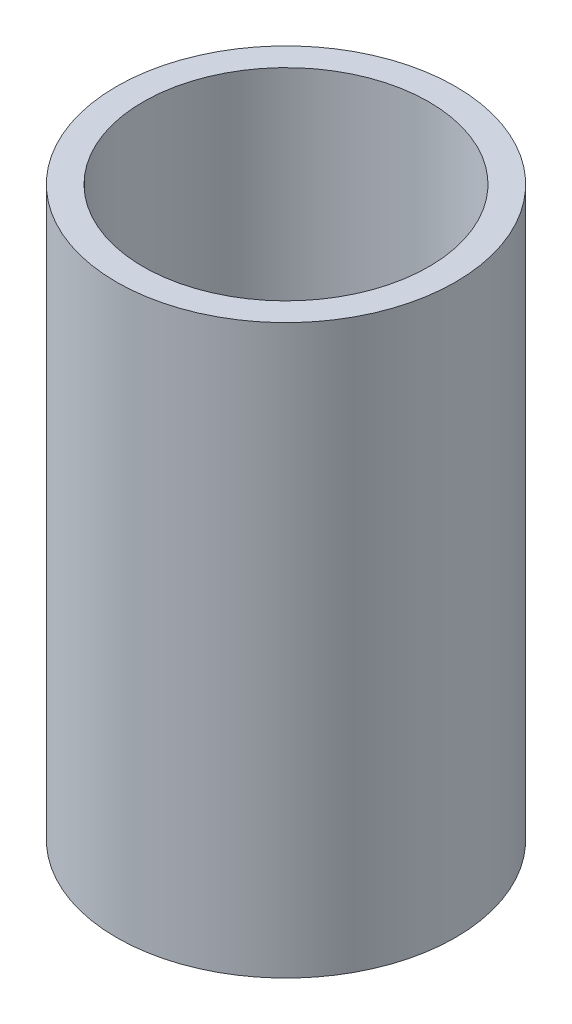
ISO-10303-21;
HEADER;
FILE_DESCRIPTION(('STEP AP214'),'2;1');
FILE_NAME('part.step','',(''),(''),'','','');
FILE_SCHEMA(('AUTOMOTIVE_DESIGN { 1 0 10303 214 1 1 1 1 }'));
ENDSEC;
DATA;
#1=APPLICATION_CONTEXT('core data for automotive mechanical design processes');
#2=APPLICATION_PROTOCOL_DEFINITION('international standard','automotive_design',2000,#1);
#3=PRODUCT_CONTEXT('',#1,'mechanical');
#4=PRODUCT('Part','Part','',(#3));
#5=PRODUCT_RELATED_PRODUCT_CATEGORY('part','',(#4));
#6=PRODUCT_DEFINITION_FORMATION('','',#4);
#7=PRODUCT_DEFINITION_CONTEXT('part definition',#1,'design');
#8=PRODUCT_DEFINITION('design','',#6,#7);
#9=PRODUCT_DEFINITION_SHAPE('','',#8);
#10=(LENGTH_UNIT() NAMED_UNIT(*) SI_UNIT(.MILLI.,.METRE.));
#11=(NAMED_UNIT(*) PLANE_ANGLE_UNIT() SI_UNIT($,.RADIAN.));
#12=(NAMED_UNIT(*) SI_UNIT($,.STERADIAN.) SOLID_ANGLE_UNIT());
#13=UNCERTAINTY_MEASURE_WITH_UNIT(LENGTH_MEASURE(1.E-05),#10,'distance_accuracy_value','');
#14=(GEOMETRIC_REPRESENTATION_CONTEXT(3) GLOBAL_UNCERTAINTY_ASSIGNED_CONTEXT((#13)) GLOBAL_UNIT_ASSIGNED_CONTEXT((#10,
#11,#12)) REPRESENTATION_CONTEXT('',''));
#15=CARTESIAN_POINT('',(0.,0.,0.));
#16=DIRECTION('',(0.,0.,1.));
#17=DIRECTION('',(1.,0.,0.));
#18=AXIS2_PLACEMENT_3D('',#15,#16,#17);
#19=CARTESIAN_POINT('',(0.,83.7349142978828,0.));
#20=DIRECTION('',(0.,-1.,0.));
#21=DIRECTION('',(0.,0.,-1.));
#22=AXIS2_PLACEMENT_3D('',#19,#20,#21);
#23=CYLINDRICAL_SURFACE('',#22,25.);
#24=CARTESIAN_POINT('',(0.,83.7349142978828,0.));
#25=DIRECTION('',(0.,1.,0.));
#26=DIRECTION('',(0.,0.,1.));
#27=AXIS2_PLACEMENT_3D('',#24,#25,#26);
#28=CIRCLE('',#27,25.);
#29=CARTESIAN_POINT('',(0.,83.7349142978828,-25.));
#30=VERTEX_POINT('',#29);
#31=EDGE_CURVE('E10',#30,#30,#28,.T.);
#32=CARTESIAN_POINT('',(0.,0.,0.));
#33=DIRECTION('',(0.,1.,0.));
#34=DIRECTION('',(0.,0.,1.));
#35=AXIS2_PLACEMENT_3D('',#32,#33,#34);
#36=CIRCLE('',#35,25.);
#37=CARTESIAN_POINT('',(0.,0.,-25.));
#38=VERTEX_POINT('',#37);
#39=EDGE_CURVE('E37',#38,#38,#36,.T.);
#40=CARTESIAN_POINT('',(0.,83.7349142978828,-25.));
#41=CARTESIAN_POINT('',(0.,82.8626756072798,-25.));
#42=CARTESIAN_POINT('',(0.,81.9904369166769,-25.));
#43=CARTESIAN_POINT('',(0.,80.245959535471,-25.));
#44=CARTESIAN_POINT('',(0.,79.373720844868,-25.));
#45=CARTESIAN_POINT('',(0.,77.6292434636621,-25.));
#46=CARTESIAN_POINT('',(0.,76.7570047730592,-25.));
#47=CARTESIAN_POINT('',(0.,75.0125273918533,-25.));
#48=CARTESIAN_POINT('',(0.,74.1402887012503,-25.));
#49=CARTESIAN_POINT('',(0.,72.3958113200445,-25.));
#50=CARTESIAN_POINT('',(0.,71.5235726294415,-25.));
#51=CARTESIAN_POINT('',(0.,69.7790952482356,-25.));
#52=CARTESIAN_POINT('',(0.,68.9068565576327,-25.));
#53=CARTESIAN_POINT('',(0.,67.1623791764268,-25.));
#54=CARTESIAN_POINT('',(0.,66.2901404858238,-25.));
#55=CARTESIAN_POINT('',(0.,64.5456631046179,-25.));
#56=CARTESIAN_POINT('',(0.,63.673424414015,-25.));
#57=CARTESIAN_POINT('',(0.,61.9289470328091,-25.));
#58=CARTESIAN_POINT('',(0.,61.0567083422062,-25.));
#59=CARTESIAN_POINT('',(0.,59.3122309610003,-25.));
#60=CARTESIAN_POINT('',(0.,58.4399922703973,-25.));
#61=CARTESIAN_POINT('',(0.,56.6955148891914,-25.));
#62=CARTESIAN_POINT('',(0.,55.8232761985885,-25.));
#63=CARTESIAN_POINT('',(0.,54.0787988173826,-25.));
#64=CARTESIAN_POINT('',(0.,53.2065601267797,-25.));
#65=CARTESIAN_POINT('',(0.,51.4620827455738,-25.));
#66=CARTESIAN_POINT('',(0.,50.5898440549708,-25.));
#67=CARTESIAN_POINT('',(0.,48.8453666737649,-25.));
#68=CARTESIAN_POINT('',(0.,47.973127983162,-25.));
#69=CARTESIAN_POINT('',(0.,46.2286506019561,-25.));
#70=CARTESIAN_POINT('',(0.,45.3564119113531,-25.));
#71=CARTESIAN_POINT('',(0.,43.6119345301473,-25.));
#72=CARTESIAN_POINT('',(0.,42.7396958395443,-25.));
#73=CARTESIAN_POINT('',(0.,40.9952184583384,-25.));
#74=CARTESIAN_POINT('',(0.,40.1229797677355,-25.));
#75=CARTESIAN_POINT('',(0.,38.3785023865296,-25.));
#76=CARTESIAN_POINT('',(0.,37.5062636959266,-25.));
#77=CARTESIAN_POINT('',(0.,35.7617863147208,-25.));
#78=CARTESIAN_POINT('',(0.,34.8895476241178,-25.));
#79=CARTESIAN_POINT('',(0.,33.1450702429119,-25.));
#80=CARTESIAN_POINT('',(0.,32.272831552309,-25.));
#81=CARTESIAN_POINT('',(0.,30.5283541711031,-25.));
#82=CARTESIAN_POINT('',(0.,29.6561154805001,-25.));
#83=CARTESIAN_POINT('',(0.,27.9116380992942,-25.));
#84=CARTESIAN_POINT('',(0.,27.0393994086913,-25.));
#85=CARTESIAN_POINT('',(0.,25.2949220274854,-25.));
#86=CARTESIAN_POINT('',(0.,24.4226833368825,-25.));
#87=CARTESIAN_POINT('',(0.,22.6782059556766,-25.));
#88=CARTESIAN_POINT('',(0.,21.8059672650736,-25.));
#89=CARTESIAN_POINT('',(0.,20.0614898838677,-25.));
#90=CARTESIAN_POINT('',(0.,19.1892511932648,-25.));
#91=CARTESIAN_POINT('',(0.,17.4447738120589,-25.));
#92=CARTESIAN_POINT('',(0.,16.572535121456,-25.));
#93=CARTESIAN_POINT('',(0.,14.8280577402501,-25.));
#94=CARTESIAN_POINT('',(0.,13.9558190496471,-25.));
#95=CARTESIAN_POINT('',(0.,12.2113416684412,-25.));
#96=CARTESIAN_POINT('',(0.,11.3391029778383,-25.));
#97=CARTESIAN_POINT('',(0.,9.5946255966324,-25.));
#98=CARTESIAN_POINT('',(0.,8.72238690602945,-25.));
#99=CARTESIAN_POINT('',(0.,6.97790952482356,-25.));
#100=CARTESIAN_POINT('',(0.,6.10567083422062,-25.));
#101=CARTESIAN_POINT('',(0.,4.36119345301473,-25.));
#102=CARTESIAN_POINT('',(0.,3.48895476241178,-25.));
#103=CARTESIAN_POINT('',(0.,1.74447738120589,-25.));
#104=CARTESIAN_POINT('',(0.,0.872238690602947,-25.));
#105=CARTESIAN_POINT('',(0.,0.,-25.));
#106=B_SPLINE_CURVE_WITH_KNOTS('',3,(#40,#41,#42,#43,#44,#45,#46,#47,#48,#49,#50,#51,#52,#53,
#54,#55,#56,#57,#58,#59,#60,#61,#62,#63,#64,#65,#66,#67,#68,#69,#70,#71,#72,#73,#74,#75,#76,#77,
#78,#79,#80,#81,#82,#83,#84,#85,#86,#87,#88,#89,#90,#91,#92,#93,#94,#95,#96,#97,#98,#99,#100,
#101,#102,#103,#104,#105),.UNSPECIFIED.,.F.,.F.,(4,2,2,2,2,2,2,2,2,2,2,2,2,2,2,2,2,2,2,2,2,2,2,
2,2,2,2,2,2,2,2,2,4),(0.,2.61671607180884,5.23343214361768,7.85014821542651,10.4668642872354,
13.0835803590442,15.700296430853,18.3170125026619,20.9337285744707,23.5504446462795,
26.1671607180884,28.7838767898972,31.400592861706,34.0173089335149,36.6340250053237,
39.2507410771326,41.8674571489414,44.4841732207502,47.1008892925591,49.7176053643679,
52.3343214361767,54.9510375079856,57.5677535797944,60.1844696516032,62.8011857234121,
65.4179017952209,68.0346178670297,70.6513339388386,73.2680500106474,75.8847660824562,
78.5014821542651,81.1181982260739,83.7349142978828),.UNSPECIFIED.);
#107=EDGE_CURVE('BSEAM40',#30,#38,#106,.T.);
#108=ORIENTED_EDGE('',*,*,#31,.F.);
#109=ORIENTED_EDGE('',*,*,#39,.T.);
#110=ORIENTED_EDGE('',*,*,#107,.T.);
#111=ORIENTED_EDGE('',*,*,#107,.F.);
#112=EDGE_LOOP('',(#108,#110,#109,#111));
#113=FACE_BOUND('',#112,.T.);
#114=ADVANCED_FACE('F40',(#113),#23,.T.);
#115=CARTESIAN_POINT('',(0.,83.7349142978828,0.));
#116=DIRECTION('',(0.,1.,0.));
#117=DIRECTION('',(0.,0.,1.));
#118=AXIS2_PLACEMENT_3D('',#115,#116,#117);
#119=PLANE('',#118);
#120=CARTESIAN_POINT('',(0.,83.7349142978828,0.));
#121=DIRECTION('',(0.,1.,0.));
#122=DIRECTION('',(0.,0.,1.));
#123=AXIS2_PLACEMENT_3D('',#120,#121,#122);
#124=CIRCLE('',#123,21.0718286667978);
#125=CARTESIAN_POINT('',(0.,83.7349142978827,-21.0718286667978));
#126=VERTEX_POINT('',#125);
#127=EDGE_CURVE('E50',#126,#126,#124,.T.);
#128=ORIENTED_EDGE('',*,*,#127,.F.);
#129=EDGE_LOOP('',(#128));
#130=FACE_BOUND('',#129,.T.);
#131=ORIENTED_EDGE('',*,*,#31,.T.);
#132=EDGE_LOOP('',(#131));
#133=FACE_BOUND('',#132,.T.);
#134=ADVANCED_FACE('F59',(#130,#133),#119,.T.);
#135=CARTESIAN_POINT('',(0.,0.,0.));
#136=DIRECTION('',(0.,1.,0.));
#137=DIRECTION('',(0.,0.,1.));
#138=AXIS2_PLACEMENT_3D('',#135,#136,#137);
#139=PLANE('',#138);
#140=CARTESIAN_POINT('',(0.,0.,0.));
#141=DIRECTION('',(0.,1.,0.));
#142=DIRECTION('',(0.,0.,1.));
#143=AXIS2_PLACEMENT_3D('',#140,#141,#142);
#144=CIRCLE('',#143,21.0718286667978);
#145=CARTESIAN_POINT('',(0.,0.,-21.0718286667978));
#146=VERTEX_POINT('',#145);
#147=EDGE_CURVE('E47',#146,#146,#144,.T.);
#148=ORIENTED_EDGE('',*,*,#147,.T.);
#149=EDGE_LOOP('',(#148));
#150=FACE_BOUND('',#149,.T.);
#151=ORIENTED_EDGE('',*,*,#39,.F.);
#152=EDGE_LOOP('',(#151));
#153=FACE_BOUND('',#152,.T.);
#154=ADVANCED_FACE('F58',(#150,#153),#139,.F.);
#155=CARTESIAN_POINT('',(0.,83.7349142978828,0.));
#156=DIRECTION('',(0.,-1.,0.));
#157=DIRECTION('',(0.,0.,-1.));
#158=AXIS2_PLACEMENT_3D('',#155,#156,#157);
#159=CYLINDRICAL_SURFACE('',#158,21.0718286667978);
#160=CARTESIAN_POINT('',(0.,83.7349142978827,-21.0718286667978));
#161=CARTESIAN_POINT('',(0.,82.8626756072798,-21.0718286667978));
#162=CARTESIAN_POINT('',(0.,81.9904369166769,-21.0718286667978));
#163=CARTESIAN_POINT('',(0.,80.245959535471,-21.0718286667978));
#164=CARTESIAN_POINT('',(0.,79.373720844868,-21.0718286667978));
#165=CARTESIAN_POINT('',(0.,77.6292434636621,-21.0718286667978));
#166=CARTESIAN_POINT('',(0.,76.7570047730592,-21.0718286667978));
#167=CARTESIAN_POINT('',(0.,75.0125273918533,-21.0718286667978));
#168=CARTESIAN_POINT('',(0.,74.1402887012503,-21.0718286667978));
#169=CARTESIAN_POINT('',(0.,72.3958113200445,-21.0718286667978));
#170=CARTESIAN_POINT('',(0.,71.5235726294415,-21.0718286667978));
#171=CARTESIAN_POINT('',(0.,69.7790952482356,-21.0718286667978));
#172=CARTESIAN_POINT('',(0.,68.9068565576327,-21.0718286667978));
#173=CARTESIAN_POINT('',(0.,67.1623791764268,-21.0718286667978));
#174=CARTESIAN_POINT('',(0.,66.2901404858238,-21.0718286667978));
#175=CARTESIAN_POINT('',(0.,64.5456631046179,-21.0718286667978));
#176=CARTESIAN_POINT('',(0.,63.673424414015,-21.0718286667978));
#177=CARTESIAN_POINT('',(0.,61.9289470328091,-21.0718286667978));
#178=CARTESIAN_POINT('',(0.,61.0567083422062,-21.0718286667978));
#179=CARTESIAN_POINT('',(0.,59.3122309610003,-21.0718286667978));
#180=CARTESIAN_POINT('',(0.,58.4399922703973,-21.0718286667978));
#181=CARTESIAN_POINT('',(0.,56.6955148891914,-21.0718286667978));
#182=CARTESIAN_POINT('',(0.,55.8232761985885,-21.0718286667978));
#183=CARTESIAN_POINT('',(0.,54.0787988173826,-21.0718286667978));
#184=CARTESIAN_POINT('',(0.,53.2065601267797,-21.0718286667978));
#185=CARTESIAN_POINT('',(0.,51.4620827455738,-21.0718286667978));
#186=CARTESIAN_POINT('',(0.,50.5898440549708,-21.0718286667978));
#187=CARTESIAN_POINT('',(0.,48.8453666737649,-21.0718286667978));
#188=CARTESIAN_POINT('',(0.,47.973127983162,-21.0718286667978));
#189=CARTESIAN_POINT('',(0.,46.2286506019561,-21.0718286667978));
#190=CARTESIAN_POINT('',(0.,45.3564119113532,-21.0718286667978));
#191=CARTESIAN_POINT('',(0.,43.6119345301473,-21.0718286667978));
#192=CARTESIAN_POINT('',(0.,42.7396958395443,-21.0718286667978));
#193=CARTESIAN_POINT('',(0.,40.9952184583384,-21.0718286667978));
#194=CARTESIAN_POINT('',(0.,40.1229797677355,-21.0718286667978));
#195=CARTESIAN_POINT('',(0.,38.3785023865296,-21.0718286667978));
#196=CARTESIAN_POINT('',(0.,37.5062636959267,-21.0718286667978));
#197=CARTESIAN_POINT('',(0.,35.7617863147208,-21.0718286667978));
#198=CARTESIAN_POINT('',(0.,34.8895476241178,-21.0718286667978));
#199=CARTESIAN_POINT('',(0.,33.1450702429119,-21.0718286667978));
#200=CARTESIAN_POINT('',(0.,32.272831552309,-21.0718286667978));
#201=CARTESIAN_POINT('',(0.,30.5283541711031,-21.0718286667978));
#202=CARTESIAN_POINT('',(0.,29.6561154805001,-21.0718286667978));
#203=CARTESIAN_POINT('',(0.,27.9116380992943,-21.0718286667978));
#204=CARTESIAN_POINT('',(0.,27.0393994086913,-21.0718286667978));
#205=CARTESIAN_POINT('',(0.,25.2949220274854,-21.0718286667978));
#206=CARTESIAN_POINT('',(0.,24.4226833368825,-21.0718286667978));
#207=CARTESIAN_POINT('',(0.,22.6782059556766,-21.0718286667978));
#208=CARTESIAN_POINT('',(0.,21.8059672650736,-21.0718286667978));
#209=CARTESIAN_POINT('',(0.,20.0614898838677,-21.0718286667978));
#210=CARTESIAN_POINT('',(0.,19.1892511932648,-21.0718286667978));
#211=CARTESIAN_POINT('',(0.,17.4447738120589,-21.0718286667978));
#212=CARTESIAN_POINT('',(0.,16.572535121456,-21.0718286667978));
#213=CARTESIAN_POINT('',(0.,14.8280577402501,-21.0718286667978));
#214=CARTESIAN_POINT('',(0.,13.9558190496471,-21.0718286667978));
#215=CARTESIAN_POINT('',(0.,12.2113416684412,-21.0718286667978));
#216=CARTESIAN_POINT('',(0.,11.3391029778383,-21.0718286667978));
#217=CARTESIAN_POINT('',(0.,9.5946255966324,-21.0718286667978));
#218=CARTESIAN_POINT('',(0.,8.72238690602945,-21.0718286667978));
#219=CARTESIAN_POINT('',(0.,6.97790952482356,-21.0718286667978));
#220=CARTESIAN_POINT('',(0.,6.10567083422062,-21.0718286667978));
#221=CARTESIAN_POINT('',(0.,4.36119345301473,-21.0718286667978));
#222=CARTESIAN_POINT('',(0.,3.48895476241178,-21.0718286667978));
#223=CARTESIAN_POINT('',(0.,1.74447738120589,-21.0718286667978));
#224=CARTESIAN_POINT('',(0.,0.872238690602947,-21.0718286667978));
#225=CARTESIAN_POINT('',(0.,0.,-21.0718286667978));
#226=B_SPLINE_CURVE_WITH_KNOTS('',3,(#160,#161,#162,#163,#164,#165,#166,#167,#168,#169,#170,
#171,#172,#173,#174,#175,#176,#177,#178,#179,#180,#181,#182,#183,#184,#185,#186,#187,#188,#189,
#190,#191,#192,#193,#194,#195,#196,#197,#198,#199,#200,#201,#202,#203,#204,#205,#206,#207,#208,
#209,#210,#211,#212,#213,#214,#215,#216,#217,#218,#219,#220,#221,#222,#223,#224,#225),
.UNSPECIFIED.,.F.,.F.,(4,2,2,2,2,2,2,2,2,2,2,2,2,2,2,2,2,2,2,2,2,2,2,2,2,2,2,2,2,2,2,2,4),(0.,
2.61671607180883,5.23343214361767,7.8501482154265,10.4668642872353,13.0835803590442,
15.700296430853,18.3170125026618,20.9337285744707,23.5504446462795,26.1671607180883,
28.7838767898972,31.400592861706,34.0173089335149,36.6340250053237,39.2507410771325,
41.8674571489414,44.4841732207502,47.100889292559,49.7176053643679,52.3343214361767,
54.9510375079855,57.5677535797944,60.1844696516032,62.801185723412,65.4179017952209,
68.0346178670297,70.6513339388386,73.2680500106474,75.8847660824562,78.5014821542651,
81.1181982260739,83.7349142978827),.UNSPECIFIED.);
#227=EDGE_CURVE('BSEAM54',#126,#146,#226,.T.);
#228=ORIENTED_EDGE('',*,*,#127,.T.);
#229=ORIENTED_EDGE('',*,*,#147,.F.);
#230=ORIENTED_EDGE('',*,*,#227,.T.);
#231=ORIENTED_EDGE('',*,*,#227,.F.);
#232=EDGE_LOOP('',(#228,#230,#229,#231));
#233=FACE_BOUND('',#232,.T.);
#234=ADVANCED_FACE('F54',(#233),#159,.F.);
#235=CLOSED_SHELL('',(#114,#134,#154,#234));
#236=MANIFOLD_SOLID_BREP('B2',#235);
#237=ADVANCED_BREP_SHAPE_REPRESENTATION('',(#18,#236),#14);
#238=SHAPE_DEFINITION_REPRESENTATION(#9,#237);
ENDSEC;
END-ISO-10303-21;
